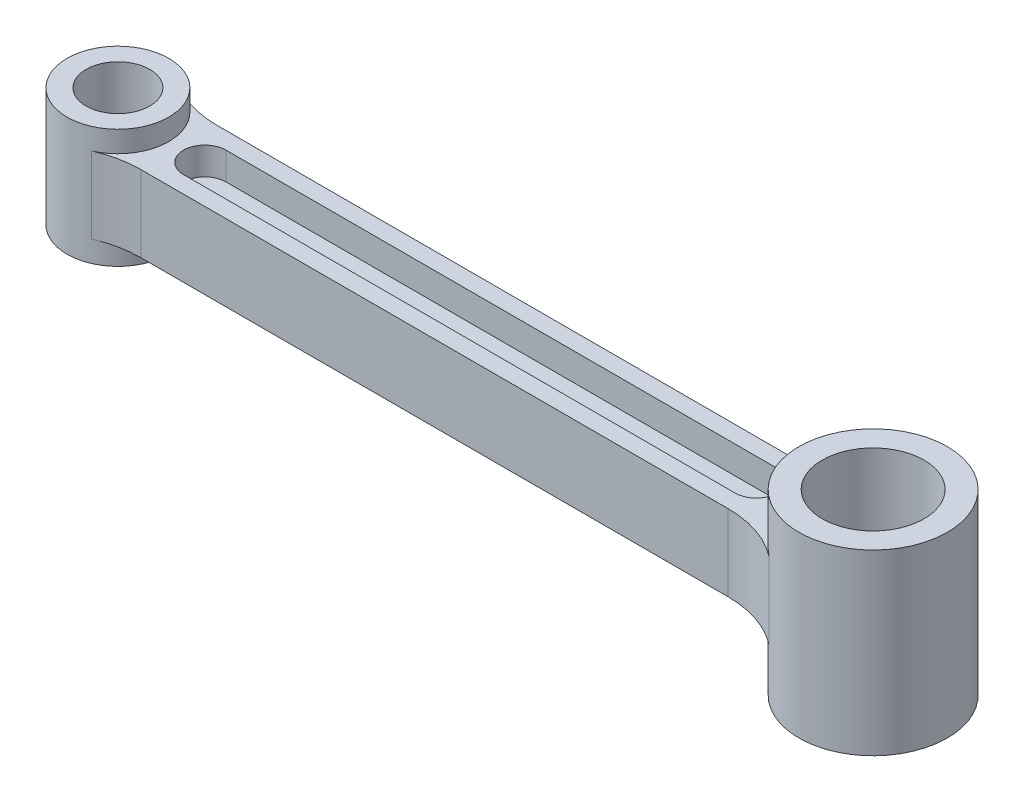
ISO-10303-21;
HEADER;
FILE_DESCRIPTION(('STEP AP214'),'2;1');
FILE_NAME('part.step','',(''),(''),'','','');
FILE_SCHEMA(('AUTOMOTIVE_DESIGN { 1 0 10303 214 1 1 1 1 }'));
ENDSEC;
DATA;
#1=APPLICATION_CONTEXT('core data for automotive mechanical design processes');
#2=APPLICATION_PROTOCOL_DEFINITION('international standard','automotive_design',2000,#1);
#3=PRODUCT_CONTEXT('',#1,'mechanical');
#4=PRODUCT('Part','Part','',(#3));
#5=PRODUCT_RELATED_PRODUCT_CATEGORY('part','',(#4));
#6=PRODUCT_DEFINITION_FORMATION('','',#4);
#7=PRODUCT_DEFINITION_CONTEXT('part definition',#1,'design');
#8=PRODUCT_DEFINITION('design','',#6,#7);
#9=PRODUCT_DEFINITION_SHAPE('','',#8);
#10=(LENGTH_UNIT() NAMED_UNIT(*) SI_UNIT(.MILLI.,.METRE.));
#11=(NAMED_UNIT(*) PLANE_ANGLE_UNIT() SI_UNIT($,.RADIAN.));
#12=(NAMED_UNIT(*) SI_UNIT($,.STERADIAN.) SOLID_ANGLE_UNIT());
#13=UNCERTAINTY_MEASURE_WITH_UNIT(LENGTH_MEASURE(1.E-05),#10,'distance_accuracy_value','');
#14=(GEOMETRIC_REPRESENTATION_CONTEXT(3) GLOBAL_UNCERTAINTY_ASSIGNED_CONTEXT((#13)) GLOBAL_UNIT_ASSIGNED_CONTEXT((#10,
#11,#12)) REPRESENTATION_CONTEXT('',''));
#15=CARTESIAN_POINT('',(0.,0.,0.));
#16=DIRECTION('',(0.,0.,1.));
#17=DIRECTION('',(1.,0.,0.));
#18=AXIS2_PLACEMENT_3D('',#15,#16,#17);
#19=CARTESIAN_POINT('',(178.,0.,9.));
#20=DIRECTION('',(0.,1.,0.));
#21=DIRECTION('',(-1.,0.,0.));
#22=AXIS2_PLACEMENT_3D('',#19,#20,#21);
#23=PLANE('',#22);
#24=CARTESIAN_POINT('',(0.,0.,0.));
#25=DIRECTION('',(0.,1.,0.));
#26=DIRECTION('',(-1.,0.,0.));
#27=AXIS2_PLACEMENT_3D('',#24,#25,#26);
#28=CIRCLE('',#27,12.);
#29=CARTESIAN_POINT('',(4.79583152331272,0.,11.));
#30=VERTEX_POINT('',#29);
#31=CARTESIAN_POINT('',(4.79583152331272,0.,-11.));
#32=VERTEX_POINT('',#31);
#33=EDGE_CURVE('E76',#30,#32,#28,.T.);
#34=ORIENTED_EDGE('',*,*,#33,.T.);
#35=CARTESIAN_POINT('',(14.3874945699382,0.,-33.));
#36=DIRECTION('',(0.,1.,0.));
#37=DIRECTION('',(-1.,0.,0.));
#38=AXIS2_PLACEMENT_3D('',#35,#36,#37);
#39=CIRCLE('',#38,24.);
#40=CARTESIAN_POINT('',(14.3874945699382,0.,-9.));
#41=VERTEX_POINT('',#40);
#42=EDGE_CURVE('E311',#32,#41,#39,.T.);
#43=ORIENTED_EDGE('',*,*,#42,.T.);
#44=DIRECTION('',(1.,0.,0.));
#45=VECTOR('',#44,1.);
#46=CARTESIAN_POINT('',(178.,0.,-9.));
#47=LINE('',#46,#45);
#48=CARTESIAN_POINT('',(152.844799755799,0.,-9.));
#49=VERTEX_POINT('',#48);
#50=EDGE_CURVE('E269',#41,#49,#47,.T.);
#51=ORIENTED_EDGE('',*,*,#50,.T.);
#52=CARTESIAN_POINT('',(152.844799755799,0.,-33.));
#53=DIRECTION('',(0.,1.,0.));
#54=DIRECTION('',(-1.,0.,0.));
#55=AXIS2_PLACEMENT_3D('',#52,#53,#54);
#56=CIRCLE('',#55,24.);
#57=CARTESIAN_POINT('',(167.397739937577,0.,-13.9156626506024));
#58=VERTEX_POINT('',#57);
#59=EDGE_CURVE('E308',#49,#58,#56,.T.);
#60=ORIENTED_EDGE('',*,*,#59,.T.);
#61=CARTESIAN_POINT('',(178.009258820123,0.,0.));
#62=DIRECTION('',(0.,1.,0.));
#63=DIRECTION('',(-1.,0.,0.));
#64=AXIS2_PLACEMENT_3D('',#61,#62,#63);
#65=CIRCLE('',#64,17.5);
#66=CARTESIAN_POINT('',(167.397739937577,0.,13.9156626506024));
#67=VERTEX_POINT('',#66);
#68=EDGE_CURVE('E259',#58,#67,#65,.T.);
#69=ORIENTED_EDGE('',*,*,#68,.T.);
#70=CARTESIAN_POINT('',(152.844799755799,0.,33.));
#71=DIRECTION('',(0.,1.,0.));
#72=DIRECTION('',(-1.,0.,0.));
#73=AXIS2_PLACEMENT_3D('',#70,#71,#72);
#74=CIRCLE('',#73,24.);
#75=CARTESIAN_POINT('',(152.844799755799,0.,9.));
#76=VERTEX_POINT('',#75);
#77=EDGE_CURVE('E304',#67,#76,#74,.T.);
#78=ORIENTED_EDGE('',*,*,#77,.T.);
#79=DIRECTION('',(1.,0.,0.));
#80=VECTOR('',#79,1.);
#81=CARTESIAN_POINT('',(178.,0.,9.));
#82=LINE('',#81,#80);
#83=CARTESIAN_POINT('',(14.3874945699382,0.,9.));
#84=VERTEX_POINT('',#83);
#85=EDGE_CURVE('E270',#84,#76,#82,.T.);
#86=ORIENTED_EDGE('',*,*,#85,.F.);
#87=CARTESIAN_POINT('',(14.3874945699382,0.,33.));
#88=DIRECTION('',(0.,1.,0.));
#89=DIRECTION('',(-1.,0.,0.));
#90=AXIS2_PLACEMENT_3D('',#87,#88,#89);
#91=CIRCLE('',#90,24.);
#92=EDGE_CURVE('E69',#84,#30,#91,.T.);
#93=ORIENTED_EDGE('',*,*,#92,.T.);
#94=EDGE_LOOP('',(#34,#43,#51,#60,#69,#78,#86,#93));
#95=FACE_BOUND('',#94,.T.);
#96=CARTESIAN_POINT('',(20.4690908667564,0.,0.));
#97=DIRECTION('',(0.,1.,0.));
#98=DIRECTION('',(0.,0.,1.));
#99=AXIS2_PLACEMENT_3D('',#96,#97,#98);
#100=CIRCLE('',#99,5.);
#101=CARTESIAN_POINT('',(20.4690908667564,0.,-5.));
#102=VERTEX_POINT('',#101);
#103=CARTESIAN_POINT('',(20.4690908667564,0.,5.));
#104=VERTEX_POINT('',#103);
#105=EDGE_CURVE('E194',#102,#104,#100,.T.);
#106=ORIENTED_EDGE('',*,*,#105,.T.);
#107=DIRECTION('',(1.,0.,0.));
#108=VECTOR('',#107,1.);
#109=CARTESIAN_POINT('',(20.4690908667564,0.,5.));
#110=LINE('',#109,#108);
#111=CARTESIAN_POINT('',(150.469090866756,0.,4.99999999999998));
#112=VERTEX_POINT('',#111);
#113=EDGE_CURVE('E198',#104,#112,#110,.T.);
#114=ORIENTED_EDGE('',*,*,#113,.T.);
#115=CARTESIAN_POINT('',(150.469090866756,0.,0.));
#116=DIRECTION('',(0.,1.,0.));
#117=DIRECTION('',(0.,0.,1.));
#118=AXIS2_PLACEMENT_3D('',#115,#116,#117);
#119=CIRCLE('',#118,4.99999999999998);
#120=CARTESIAN_POINT('',(150.469090866756,0.,-5.00000000000002));
#121=VERTEX_POINT('',#120);
#122=EDGE_CURVE('E201',#112,#121,#119,.T.);
#123=ORIENTED_EDGE('',*,*,#122,.T.);
#124=DIRECTION('',(-1.,0.,0.));
#125=VECTOR('',#124,1.);
#126=CARTESIAN_POINT('',(20.4690908667564,0.,-5.));
#127=LINE('',#126,#125);
#128=EDGE_CURVE('E210',#121,#102,#127,.T.);
#129=ORIENTED_EDGE('',*,*,#128,.T.);
#130=EDGE_LOOP('',(#106,#114,#123,#129));
#131=FACE_BOUND('',#130,.T.);
#132=ADVANCED_FACE('F61',(#95,#131),#23,.F.);
#133=CARTESIAN_POINT('',(0.,18.,9.));
#134=DIRECTION('',(0.,-1.,0.));
#135=DIRECTION('',(0.,0.,-1.));
#136=AXIS2_PLACEMENT_3D('',#133,#134,#135);
#137=PLANE('',#136);
#138=DIRECTION('',(1.,0.,0.));
#139=VECTOR('',#138,1.);
#140=CARTESIAN_POINT('',(20.4690908667564,18.,5.));
#141=LINE('',#140,#139);
#142=CARTESIAN_POINT('',(20.4690908667564,18.,5.));
#143=VERTEX_POINT('',#142);
#144=CARTESIAN_POINT('',(150.469090866756,18.,4.99999999999998));
#145=VERTEX_POINT('',#144);
#146=EDGE_CURVE('E235',#143,#145,#141,.T.);
#147=ORIENTED_EDGE('',*,*,#146,.F.);
#148=CARTESIAN_POINT('',(20.4690908667564,18.,0.));
#149=DIRECTION('',(0.,1.,0.));
#150=DIRECTION('',(0.,0.,1.));
#151=AXIS2_PLACEMENT_3D('',#148,#149,#150);
#152=CIRCLE('',#151,5.);
#153=CARTESIAN_POINT('',(20.4690908667564,18.,-5.));
#154=VERTEX_POINT('',#153);
#155=EDGE_CURVE('E216',#154,#143,#152,.T.);
#156=ORIENTED_EDGE('',*,*,#155,.F.);
#157=DIRECTION('',(-1.,0.,0.));
#158=VECTOR('',#157,1.);
#159=CARTESIAN_POINT('',(20.4690908667564,18.,-5.));
#160=LINE('',#159,#158);
#161=CARTESIAN_POINT('',(150.469090866756,18.,-5.00000000000002));
#162=VERTEX_POINT('',#161);
#163=EDGE_CURVE('E224',#162,#154,#160,.T.);
#164=ORIENTED_EDGE('',*,*,#163,.F.);
#165=CARTESIAN_POINT('',(150.469090866756,18.,0.));
#166=DIRECTION('',(0.,1.,0.));
#167=DIRECTION('',(0.,0.,1.));
#168=AXIS2_PLACEMENT_3D('',#165,#166,#167);
#169=CIRCLE('',#168,4.99999999999998);
#170=EDGE_CURVE('E238',#145,#162,#169,.T.);
#171=ORIENTED_EDGE('',*,*,#170,.F.);
#172=EDGE_LOOP('',(#147,#156,#164,#171));
#173=FACE_BOUND('',#172,.T.);
#174=DIRECTION('',(-1.,0.,0.));
#175=VECTOR('',#174,1.);
#176=CARTESIAN_POINT('',(0.,18.,9.));
#177=LINE('',#176,#175);
#178=CARTESIAN_POINT('',(152.844799755799,18.,9.));
#179=VERTEX_POINT('',#178);
#180=CARTESIAN_POINT('',(14.3874945699382,18.,9.));
#181=VERTEX_POINT('',#180);
#182=EDGE_CURVE('E273',#179,#181,#177,.T.);
#183=ORIENTED_EDGE('',*,*,#182,.F.);
#184=CARTESIAN_POINT('',(152.844799755799,18.,33.));
#185=DIRECTION('',(0.,-1.,0.));
#186=DIRECTION('',(0.,0.,-1.));
#187=AXIS2_PLACEMENT_3D('',#184,#185,#186);
#188=CIRCLE('',#187,24.);
#189=CARTESIAN_POINT('',(167.397739937577,18.,13.9156626506024));
#190=VERTEX_POINT('',#189);
#191=EDGE_CURVE('E301',#179,#190,#188,.T.);
#192=ORIENTED_EDGE('',*,*,#191,.T.);
#193=CARTESIAN_POINT('',(178.009258820123,18.,0.));
#194=DIRECTION('',(0.,-1.,0.));
#195=DIRECTION('',(0.,0.,-1.));
#196=AXIS2_PLACEMENT_3D('',#193,#194,#195);
#197=CIRCLE('',#196,17.5);
#198=CARTESIAN_POINT('',(167.397739937577,18.,-13.9156626506024));
#199=VERTEX_POINT('',#198);
#200=EDGE_CURVE('E257',#190,#199,#197,.T.);
#201=ORIENTED_EDGE('',*,*,#200,.T.);
#202=CARTESIAN_POINT('',(152.844799755799,18.,-33.));
#203=DIRECTION('',(0.,-1.,0.));
#204=DIRECTION('',(0.,0.,-1.));
#205=AXIS2_PLACEMENT_3D('',#202,#203,#204);
#206=CIRCLE('',#205,24.);
#207=CARTESIAN_POINT('',(152.844799755799,18.,-9.));
#208=VERTEX_POINT('',#207);
#209=EDGE_CURVE('E306',#199,#208,#206,.T.);
#210=ORIENTED_EDGE('',*,*,#209,.T.);
#211=DIRECTION('',(-1.,0.,0.));
#212=VECTOR('',#211,1.);
#213=CARTESIAN_POINT('',(0.,18.,-9.));
#214=LINE('',#213,#212);
#215=CARTESIAN_POINT('',(14.3874945699382,18.,-9.));
#216=VERTEX_POINT('',#215);
#217=EDGE_CURVE('E274',#208,#216,#214,.T.);
#218=ORIENTED_EDGE('',*,*,#217,.T.);
#219=CARTESIAN_POINT('',(14.3874945699382,18.,-33.));
#220=DIRECTION('',(0.,-1.,0.));
#221=DIRECTION('',(0.,0.,-1.));
#222=AXIS2_PLACEMENT_3D('',#219,#220,#221);
#223=CIRCLE('',#222,24.);
#224=CARTESIAN_POINT('',(4.79583152331272,18.,-11.));
#225=VERTEX_POINT('',#224);
#226=EDGE_CURVE('E313',#216,#225,#223,.T.);
#227=ORIENTED_EDGE('',*,*,#226,.T.);
#228=CARTESIAN_POINT('',(0.,18.,0.));
#229=DIRECTION('',(0.,-1.,0.));
#230=DIRECTION('',(0.,0.,-1.));
#231=AXIS2_PLACEMENT_3D('',#228,#229,#230);
#232=CIRCLE('',#231,12.);
#233=CARTESIAN_POINT('',(4.79583152331272,18.,11.));
#234=VERTEX_POINT('',#233);
#235=EDGE_CURVE('E84',#225,#234,#232,.T.);
#236=ORIENTED_EDGE('',*,*,#235,.T.);
#237=CARTESIAN_POINT('',(14.3874945699382,18.,33.));
#238=DIRECTION('',(0.,-1.,0.));
#239=DIRECTION('',(0.,0.,-1.));
#240=AXIS2_PLACEMENT_3D('',#237,#238,#239);
#241=CIRCLE('',#240,24.);
#242=EDGE_CURVE('E12',#234,#181,#241,.T.);
#243=ORIENTED_EDGE('',*,*,#242,.T.);
#244=EDGE_LOOP('',(#183,#192,#201,#210,#218,#227,#236,#243));
#245=FACE_BOUND('',#244,.T.);
#246=ADVANCED_FACE('F347',(#173,#245),#137,.F.);
#247=CARTESIAN_POINT('',(0.,0.,9.));
#248=DIRECTION('',(0.,0.,-1.));
#249=DIRECTION('',(-1.,0.,0.));
#250=AXIS2_PLACEMENT_3D('',#247,#248,#249);
#251=PLANE('',#250);
#252=ORIENTED_EDGE('',*,*,#85,.T.);
#253=DIRECTION('',(0.,-1.,0.));
#254=VECTOR('',#253,1.);
#255=CARTESIAN_POINT('',(152.844799755799,0.,9.));
#256=LINE('',#255,#254);
#257=EDGE_CURVE('E284',#76,#179,#256,.F.);
#258=ORIENTED_EDGE('',*,*,#257,.T.);
#259=ORIENTED_EDGE('',*,*,#182,.T.);
#260=DIRECTION('',(0.,1.,0.));
#261=VECTOR('',#260,1.);
#262=CARTESIAN_POINT('',(14.3874945699382,0.,9.));
#263=LINE('',#262,#261);
#264=EDGE_CURVE('E277',#181,#84,#263,.F.);
#265=ORIENTED_EDGE('',*,*,#264,.T.);
#266=EDGE_LOOP('',(#252,#258,#259,#265));
#267=FACE_BOUND('',#266,.T.);
#268=ADVANCED_FACE('F345',(#267),#251,.F.);
#269=CARTESIAN_POINT('',(0.,0.,-9.));
#270=DIRECTION('',(0.,0.,-1.));
#271=DIRECTION('',(-1.,0.,0.));
#272=AXIS2_PLACEMENT_3D('',#269,#270,#271);
#273=PLANE('',#272);
#274=ORIENTED_EDGE('',*,*,#217,.F.);
#275=DIRECTION('',(0.,1.,0.));
#276=VECTOR('',#275,1.);
#277=CARTESIAN_POINT('',(152.844799755799,0.,-9.));
#278=LINE('',#277,#276);
#279=EDGE_CURVE('E295',#208,#49,#278,.F.);
#280=ORIENTED_EDGE('',*,*,#279,.T.);
#281=ORIENTED_EDGE('',*,*,#50,.F.);
#282=DIRECTION('',(0.,-1.,0.));
#283=VECTOR('',#282,1.);
#284=CARTESIAN_POINT('',(14.3874945699382,18.,-9.));
#285=LINE('',#284,#283);
#286=EDGE_CURVE('E293',#41,#216,#285,.F.);
#287=ORIENTED_EDGE('',*,*,#286,.T.);
#288=EDGE_LOOP('',(#274,#280,#281,#287));
#289=FACE_BOUND('',#288,.T.);
#290=ADVANCED_FACE('F330',(#289),#273,.T.);
#291=CARTESIAN_POINT('',(0.,-5.00000000000001,0.));
#292=DIRECTION('',(0.,1.,0.));
#293=DIRECTION('',(-1.,0.,0.));
#294=AXIS2_PLACEMENT_3D('',#291,#292,#293);
#295=CYLINDRICAL_SURFACE('',#294,12.);
#296=CARTESIAN_POINT('',(0.,-5.00000000000001,0.));
#297=DIRECTION('',(0.,1.,0.));
#298=DIRECTION('',(-1.,0.,0.));
#299=AXIS2_PLACEMENT_3D('',#296,#297,#298);
#300=CIRCLE('',#299,12.);
#301=CARTESIAN_POINT('',(-12.,-5.00000000000001,0.));
#302=VERTEX_POINT('',#301);
#303=EDGE_CURVE('E261',#302,#302,#300,.T.);
#304=ORIENTED_EDGE('',*,*,#303,.T.);
#305=EDGE_LOOP('',(#304));
#306=FACE_BOUND('',#305,.T.);
#307=CARTESIAN_POINT('',(0.,23.,0.));
#308=DIRECTION('',(0.,1.,0.));
#309=DIRECTION('',(-1.,0.,0.));
#310=AXIS2_PLACEMENT_3D('',#307,#308,#309);
#311=CIRCLE('',#310,12.);
#312=CARTESIAN_POINT('',(-12.,23.,0.));
#313=VERTEX_POINT('',#312);
#314=EDGE_CURVE('E264',#313,#313,#311,.T.);
#315=ORIENTED_EDGE('',*,*,#314,.F.);
#316=EDGE_LOOP('',(#315));
#317=FACE_BOUND('',#316,.T.);
#318=DIRECTION('',(0.,1.,0.));
#319=VECTOR('',#318,1.);
#320=CARTESIAN_POINT('',(4.79583152331272,-5.00000000000001,-11.));
#321=LINE('',#320,#319);
#322=EDGE_CURVE('E299',#225,#32,#321,.F.);
#323=ORIENTED_EDGE('',*,*,#322,.T.);
#324=ORIENTED_EDGE('',*,*,#33,.F.);
#325=DIRECTION('',(0.,1.,0.));
#326=VECTOR('',#325,1.);
#327=CARTESIAN_POINT('',(4.79583152331272,-5.00000000000001,11.));
#328=LINE('',#327,#326);
#329=EDGE_CURVE('E297',#30,#234,#328,.T.);
#330=ORIENTED_EDGE('',*,*,#329,.T.);
#331=ORIENTED_EDGE('',*,*,#235,.F.);
#332=EDGE_LOOP('',(#323,#324,#330,#331));
#333=FACE_BOUND('',#332,.T.);
#334=ADVANCED_FACE('F320',(#306,#317,#333),#295,.T.);
#335=CARTESIAN_POINT('',(0.,-5.00000000000001,0.));
#336=DIRECTION('',(0.,1.,0.));
#337=DIRECTION('',(-1.,0.,0.));
#338=AXIS2_PLACEMENT_3D('',#335,#336,#337);
#339=PLANE('',#338);
#340=CARTESIAN_POINT('',(0.,-5.00000000000001,0.));
#341=DIRECTION('',(0.,1.,0.));
#342=DIRECTION('',(-1.,0.,0.));
#343=AXIS2_PLACEMENT_3D('',#340,#341,#342);
#344=CIRCLE('',#343,7.5);
#345=CARTESIAN_POINT('',(-7.5,-5.00000000000001,0.));
#346=VERTEX_POINT('',#345);
#347=EDGE_CURVE('E648',#346,#346,#344,.F.);
#348=ORIENTED_EDGE('',*,*,#347,.F.);
#349=EDGE_LOOP('',(#348));
#350=FACE_BOUND('',#349,.T.);
#351=ORIENTED_EDGE('',*,*,#303,.F.);
#352=EDGE_LOOP('',(#351));
#353=FACE_BOUND('',#352,.T.);
#354=ADVANCED_FACE('F406',(#350,#353),#339,.F.);
#355=CARTESIAN_POINT('',(0.,23.,0.));
#356=DIRECTION('',(0.,1.,0.));
#357=DIRECTION('',(-1.,0.,0.));
#358=AXIS2_PLACEMENT_3D('',#355,#356,#357);
#359=PLANE('',#358);
#360=CARTESIAN_POINT('',(0.,23.,0.));
#361=DIRECTION('',(0.,1.,0.));
#362=DIRECTION('',(-1.,0.,0.));
#363=AXIS2_PLACEMENT_3D('',#360,#361,#362);
#364=CIRCLE('',#363,7.5);
#365=CARTESIAN_POINT('',(-7.5,23.,0.));
#366=VERTEX_POINT('',#365);
#367=EDGE_CURVE('E204',#366,#366,#364,.F.);
#368=ORIENTED_EDGE('',*,*,#367,.T.);
#369=EDGE_LOOP('',(#368));
#370=FACE_BOUND('',#369,.T.);
#371=ORIENTED_EDGE('',*,*,#314,.T.);
#372=EDGE_LOOP('',(#371));
#373=FACE_BOUND('',#372,.T.);
#374=ADVANCED_FACE('F402',(#370,#373),#359,.T.);
#375=CARTESIAN_POINT('',(178.009258820123,30.,0.));
#376=DIRECTION('',(0.,-1.,0.));
#377=DIRECTION('',(0.,0.,-1.));
#378=AXIS2_PLACEMENT_3D('',#375,#376,#377);
#379=CYLINDRICAL_SURFACE('',#378,17.5);
#380=CARTESIAN_POINT('',(178.009258820123,30.,0.));
#381=DIRECTION('',(0.,-1.,0.));
#382=DIRECTION('',(0.,0.,-1.));
#383=AXIS2_PLACEMENT_3D('',#380,#381,#382);
#384=CIRCLE('',#383,17.5);
#385=CARTESIAN_POINT('',(178.009258820123,30.,-17.5));
#386=VERTEX_POINT('',#385);
#387=EDGE_CURVE('E245',#386,#386,#384,.T.);
#388=ORIENTED_EDGE('',*,*,#387,.T.);
#389=EDGE_LOOP('',(#388));
#390=FACE_BOUND('',#389,.T.);
#391=CARTESIAN_POINT('',(178.009258820123,-12.,0.));
#392=DIRECTION('',(0.,-1.,0.));
#393=DIRECTION('',(0.,0.,-1.));
#394=AXIS2_PLACEMENT_3D('',#391,#392,#393);
#395=CIRCLE('',#394,17.5);
#396=CARTESIAN_POINT('',(178.009258820123,-12.,-17.5));
#397=VERTEX_POINT('',#396);
#398=EDGE_CURVE('E254',#397,#397,#395,.T.);
#399=ORIENTED_EDGE('',*,*,#398,.F.);
#400=EDGE_LOOP('',(#399));
#401=FACE_BOUND('',#400,.T.);
#402=ORIENTED_EDGE('',*,*,#200,.F.);
#403=DIRECTION('',(0.,-1.,0.));
#404=VECTOR('',#403,1.);
#405=CARTESIAN_POINT('',(167.397739937577,30.,13.9156626506024));
#406=LINE('',#405,#404);
#407=EDGE_CURVE('E290',#190,#67,#406,.T.);
#408=ORIENTED_EDGE('',*,*,#407,.T.);
#409=ORIENTED_EDGE('',*,*,#68,.F.);
#410=DIRECTION('',(0.,-1.,0.));
#411=VECTOR('',#410,1.);
#412=CARTESIAN_POINT('',(167.397739937577,30.,-13.9156626506024));
#413=LINE('',#412,#411);
#414=EDGE_CURVE('E287',#58,#199,#413,.F.);
#415=ORIENTED_EDGE('',*,*,#414,.T.);
#416=EDGE_LOOP('',(#402,#408,#409,#415));
#417=FACE_BOUND('',#416,.T.);
#418=ADVANCED_FACE('F339',(#390,#401,#417),#379,.T.);
#419=CARTESIAN_POINT('',(178.009258820123,30.,0.));
#420=DIRECTION('',(0.,-1.,0.));
#421=DIRECTION('',(0.,0.,-1.));
#422=AXIS2_PLACEMENT_3D('',#419,#420,#421);
#423=PLANE('',#422);
#424=CARTESIAN_POINT('',(178.009258820123,30.,0.));
#425=DIRECTION('',(0.,-1.,0.));
#426=DIRECTION('',(0.,0.,-1.));
#427=AXIS2_PLACEMENT_3D('',#424,#425,#426);
#428=CIRCLE('',#427,12.);
#429=CARTESIAN_POINT('',(178.009258820123,30.,-12.));
#430=VERTEX_POINT('',#429);
#431=EDGE_CURVE('E656',#430,#430,#428,.F.);
#432=ORIENTED_EDGE('',*,*,#431,.F.);
#433=EDGE_LOOP('',(#432));
#434=FACE_BOUND('',#433,.T.);
#435=ORIENTED_EDGE('',*,*,#387,.F.);
#436=EDGE_LOOP('',(#435));
#437=FACE_BOUND('',#436,.T.);
#438=ADVANCED_FACE('F401',(#434,#437),#423,.F.);
#439=CARTESIAN_POINT('',(178.009258820123,-12.,0.));
#440=DIRECTION('',(0.,-1.,0.));
#441=DIRECTION('',(0.,0.,-1.));
#442=AXIS2_PLACEMENT_3D('',#439,#440,#441);
#443=PLANE('',#442);
#444=CARTESIAN_POINT('',(178.009258820123,-12.,0.));
#445=DIRECTION('',(0.,-1.,0.));
#446=DIRECTION('',(0.,0.,-1.));
#447=AXIS2_PLACEMENT_3D('',#444,#445,#446);
#448=CIRCLE('',#447,12.);
#449=CARTESIAN_POINT('',(178.009258820123,-12.,-12.));
#450=VERTEX_POINT('',#449);
#451=EDGE_CURVE('E653',#450,#450,#448,.F.);
#452=ORIENTED_EDGE('',*,*,#451,.T.);
#453=EDGE_LOOP('',(#452));
#454=FACE_BOUND('',#453,.T.);
#455=ORIENTED_EDGE('',*,*,#398,.T.);
#456=EDGE_LOOP('',(#455));
#457=FACE_BOUND('',#456,.T.);
#458=ADVANCED_FACE('F405',(#454,#457),#443,.T.);
#459=CARTESIAN_POINT('',(20.4690908667564,11.5,0.));
#460=DIRECTION('',(0.,1.,0.));
#461=DIRECTION('',(0.,0.,1.));
#462=AXIS2_PLACEMENT_3D('',#459,#460,#461);
#463=CYLINDRICAL_SURFACE('',#462,5.);
#464=ORIENTED_EDGE('',*,*,#155,.T.);
#465=DIRECTION('',(0.,1.,0.));
#466=VECTOR('',#465,1.);
#467=CARTESIAN_POINT('',(20.4690908667564,11.5,5.));
#468=LINE('',#467,#466);
#469=CARTESIAN_POINT('',(20.4690908667564,11.5,5.));
#470=VERTEX_POINT('',#469);
#471=EDGE_CURVE('E233',#470,#143,#468,.T.);
#472=ORIENTED_EDGE('',*,*,#471,.F.);
#473=CARTESIAN_POINT('',(20.4690908667564,11.5,0.));
#474=DIRECTION('',(0.,1.,0.));
#475=DIRECTION('',(0.,0.,1.));
#476=AXIS2_PLACEMENT_3D('',#473,#474,#475);
#477=CIRCLE('',#476,5.);
#478=CARTESIAN_POINT('',(20.4690908667564,11.5,-5.));
#479=VERTEX_POINT('',#478);
#480=EDGE_CURVE('E220',#479,#470,#477,.T.);
#481=ORIENTED_EDGE('',*,*,#480,.F.);
#482=DIRECTION('',(0.,1.,0.));
#483=VECTOR('',#482,1.);
#484=CARTESIAN_POINT('',(20.4690908667564,11.5,-5.));
#485=LINE('',#484,#483);
#486=EDGE_CURVE('E243',#479,#154,#485,.T.);
#487=ORIENTED_EDGE('',*,*,#486,.T.);
#488=EDGE_LOOP('',(#464,#472,#481,#487));
#489=FACE_BOUND('',#488,.T.);
#490=ADVANCED_FACE('F470',(#489),#463,.F.);
#491=CARTESIAN_POINT('',(20.4690908667564,11.5,-5.));
#492=DIRECTION('',(0.,0.,-1.));
#493=DIRECTION('',(-1.,0.,0.));
#494=AXIS2_PLACEMENT_3D('',#491,#492,#493);
#495=PLANE('',#494);
#496=ORIENTED_EDGE('',*,*,#163,.T.);
#497=ORIENTED_EDGE('',*,*,#486,.F.);
#498=DIRECTION('',(-1.,0.,0.));
#499=VECTOR('',#498,1.);
#500=CARTESIAN_POINT('',(20.4690908667564,11.5,-5.));
#501=LINE('',#500,#499);
#502=CARTESIAN_POINT('',(150.469090866756,11.5,-5.00000000000002));
#503=VERTEX_POINT('',#502);
#504=EDGE_CURVE('E230',#503,#479,#501,.T.);
#505=ORIENTED_EDGE('',*,*,#504,.F.);
#506=DIRECTION('',(0.,1.,0.));
#507=VECTOR('',#506,1.);
#508=CARTESIAN_POINT('',(150.469090866756,11.5,-5.00000000000002));
#509=LINE('',#508,#507);
#510=EDGE_CURVE('E246',#503,#162,#509,.T.);
#511=ORIENTED_EDGE('',*,*,#510,.T.);
#512=EDGE_LOOP('',(#496,#497,#505,#511));
#513=FACE_BOUND('',#512,.T.);
#514=ADVANCED_FACE('F585',(#513),#495,.F.);
#515=CARTESIAN_POINT('',(150.469090866756,11.5,0.));
#516=DIRECTION('',(0.,1.,0.));
#517=DIRECTION('',(0.,0.,1.));
#518=AXIS2_PLACEMENT_3D('',#515,#516,#517);
#519=CYLINDRICAL_SURFACE('',#518,4.99999999999998);
#520=ORIENTED_EDGE('',*,*,#170,.T.);
#521=ORIENTED_EDGE('',*,*,#510,.F.);
#522=CARTESIAN_POINT('',(150.469090866756,11.5,0.));
#523=DIRECTION('',(0.,1.,0.));
#524=DIRECTION('',(0.,0.,1.));
#525=AXIS2_PLACEMENT_3D('',#522,#523,#524);
#526=CIRCLE('',#525,4.99999999999998);
#527=CARTESIAN_POINT('',(150.469090866756,11.5,4.99999999999998));
#528=VERTEX_POINT('',#527);
#529=EDGE_CURVE('E227',#528,#503,#526,.T.);
#530=ORIENTED_EDGE('',*,*,#529,.F.);
#531=DIRECTION('',(0.,1.,0.));
#532=VECTOR('',#531,1.);
#533=CARTESIAN_POINT('',(150.469090866756,11.5,4.99999999999998));
#534=LINE('',#533,#532);
#535=EDGE_CURVE('E248',#528,#145,#534,.T.);
#536=ORIENTED_EDGE('',*,*,#535,.T.);
#537=EDGE_LOOP('',(#520,#521,#530,#536));
#538=FACE_BOUND('',#537,.T.);
#539=ADVANCED_FACE('F574',(#538),#519,.F.);
#540=CARTESIAN_POINT('',(20.4690908667564,11.5,5.));
#541=DIRECTION('',(0.,0.,1.));
#542=DIRECTION('',(1.,0.,0.));
#543=AXIS2_PLACEMENT_3D('',#540,#541,#542);
#544=PLANE('',#543);
#545=ORIENTED_EDGE('',*,*,#146,.T.);
#546=ORIENTED_EDGE('',*,*,#535,.F.);
#547=DIRECTION('',(1.,0.,0.));
#548=VECTOR('',#547,1.);
#549=CARTESIAN_POINT('',(20.4690908667564,11.5,5.));
#550=LINE('',#549,#548);
#551=EDGE_CURVE('E223',#470,#528,#550,.T.);
#552=ORIENTED_EDGE('',*,*,#551,.F.);
#553=ORIENTED_EDGE('',*,*,#471,.T.);
#554=EDGE_LOOP('',(#545,#546,#552,#553));
#555=FACE_BOUND('',#554,.T.);
#556=ADVANCED_FACE('F564',(#555),#544,.F.);
#557=CARTESIAN_POINT('',(20.4690908667564,11.5,0.));
#558=DIRECTION('',(0.,1.,0.));
#559=DIRECTION('',(0.,0.,1.));
#560=AXIS2_PLACEMENT_3D('',#557,#558,#559);
#561=PLANE('',#560);
#562=ORIENTED_EDGE('',*,*,#480,.T.);
#563=ORIENTED_EDGE('',*,*,#551,.T.);
#564=ORIENTED_EDGE('',*,*,#529,.T.);
#565=ORIENTED_EDGE('',*,*,#504,.T.);
#566=EDGE_LOOP('',(#562,#563,#564,#565));
#567=FACE_BOUND('',#566,.T.);
#568=ADVANCED_FACE('F555',(#567),#561,.T.);
#569=CARTESIAN_POINT('',(20.4690908667564,6.5,0.));
#570=DIRECTION('',(0.,-1.,0.));
#571=DIRECTION('',(1.,0.,0.));
#572=AXIS2_PLACEMENT_3D('',#569,#570,#571);
#573=CYLINDRICAL_SURFACE('',#572,5.);
#574=ORIENTED_EDGE('',*,*,#105,.F.);
#575=DIRECTION('',(0.,-1.,0.));
#576=VECTOR('',#575,1.);
#577=CARTESIAN_POINT('',(20.4690908667564,6.5,-5.));
#578=LINE('',#577,#576);
#579=CARTESIAN_POINT('',(20.4690908667564,6.5,-5.));
#580=VERTEX_POINT('',#579);
#581=EDGE_CURVE('E179',#580,#102,#578,.T.);
#582=ORIENTED_EDGE('',*,*,#581,.F.);
#583=CARTESIAN_POINT('',(20.4690908667564,6.5,0.));
#584=DIRECTION('',(0.,1.,0.));
#585=DIRECTION('',(0.,0.,1.));
#586=AXIS2_PLACEMENT_3D('',#583,#584,#585);
#587=CIRCLE('',#586,5.);
#588=CARTESIAN_POINT('',(20.4690908667564,6.5,5.));
#589=VERTEX_POINT('',#588);
#590=EDGE_CURVE('E186',#580,#589,#587,.T.);
#591=ORIENTED_EDGE('',*,*,#590,.T.);
#592=DIRECTION('',(0.,-1.,0.));
#593=VECTOR('',#592,1.);
#594=CARTESIAN_POINT('',(20.4690908667564,6.5,5.));
#595=LINE('',#594,#593);
#596=EDGE_CURVE('E214',#589,#104,#595,.T.);
#597=ORIENTED_EDGE('',*,*,#596,.T.);
#598=EDGE_LOOP('',(#574,#582,#591,#597));
#599=FACE_BOUND('',#598,.T.);
#600=ADVANCED_FACE('F190',(#599),#573,.F.);
#601=CARTESIAN_POINT('',(20.4690908667564,6.5,5.));
#602=DIRECTION('',(0.,0.,-1.));
#603=DIRECTION('',(-1.,0.,0.));
#604=AXIS2_PLACEMENT_3D('',#601,#602,#603);
#605=PLANE('',#604);
#606=ORIENTED_EDGE('',*,*,#113,.F.);
#607=ORIENTED_EDGE('',*,*,#596,.F.);
#608=DIRECTION('',(1.,0.,0.));
#609=VECTOR('',#608,1.);
#610=CARTESIAN_POINT('',(20.4690908667564,6.5,5.));
#611=LINE('',#610,#609);
#612=CARTESIAN_POINT('',(150.469090866756,6.5,4.99999999999998));
#613=VERTEX_POINT('',#612);
#614=EDGE_CURVE('E195',#589,#613,#611,.T.);
#615=ORIENTED_EDGE('',*,*,#614,.T.);
#616=DIRECTION('',(0.,-1.,0.));
#617=VECTOR('',#616,1.);
#618=CARTESIAN_POINT('',(150.469090866756,6.5,4.99999999999998));
#619=LINE('',#618,#617);
#620=EDGE_CURVE('E217',#613,#112,#619,.T.);
#621=ORIENTED_EDGE('',*,*,#620,.T.);
#622=EDGE_LOOP('',(#606,#607,#615,#621));
#623=FACE_BOUND('',#622,.T.);
#624=ADVANCED_FACE('F534',(#623),#605,.T.);
#625=CARTESIAN_POINT('',(150.469090866756,6.5,0.));
#626=DIRECTION('',(0.,-1.,0.));
#627=DIRECTION('',(1.,0.,0.));
#628=AXIS2_PLACEMENT_3D('',#625,#626,#627);
#629=CYLINDRICAL_SURFACE('',#628,4.99999999999998);
#630=ORIENTED_EDGE('',*,*,#122,.F.);
#631=ORIENTED_EDGE('',*,*,#620,.F.);
#632=CARTESIAN_POINT('',(150.469090866756,6.5,0.));
#633=DIRECTION('',(0.,1.,0.));
#634=DIRECTION('',(0.,0.,1.));
#635=AXIS2_PLACEMENT_3D('',#632,#633,#634);
#636=CIRCLE('',#635,4.99999999999998);
#637=CARTESIAN_POINT('',(150.469090866756,6.5,-5.00000000000002));
#638=VERTEX_POINT('',#637);
#639=EDGE_CURVE('E185',#613,#638,#636,.T.);
#640=ORIENTED_EDGE('',*,*,#639,.T.);
#641=DIRECTION('',(0.,-1.,0.));
#642=VECTOR('',#641,1.);
#643=CARTESIAN_POINT('',(150.469090866756,6.5,-5.00000000000002));
#644=LINE('',#643,#642);
#645=EDGE_CURVE('E181',#638,#121,#644,.T.);
#646=ORIENTED_EDGE('',*,*,#645,.T.);
#647=EDGE_LOOP('',(#630,#631,#640,#646));
#648=FACE_BOUND('',#647,.T.);
#649=ADVANCED_FACE('F524',(#648),#629,.F.);
#650=CARTESIAN_POINT('',(20.4690908667564,6.5,-5.));
#651=DIRECTION('',(0.,0.,1.));
#652=DIRECTION('',(1.,0.,0.));
#653=AXIS2_PLACEMENT_3D('',#650,#651,#652);
#654=PLANE('',#653);
#655=ORIENTED_EDGE('',*,*,#128,.F.);
#656=ORIENTED_EDGE('',*,*,#645,.F.);
#657=DIRECTION('',(-1.,0.,0.));
#658=VECTOR('',#657,1.);
#659=CARTESIAN_POINT('',(20.4690908667564,6.5,-5.));
#660=LINE('',#659,#658);
#661=EDGE_CURVE('E175',#638,#580,#660,.T.);
#662=ORIENTED_EDGE('',*,*,#661,.T.);
#663=ORIENTED_EDGE('',*,*,#581,.T.);
#664=EDGE_LOOP('',(#655,#656,#662,#663));
#665=FACE_BOUND('',#664,.T.);
#666=ADVANCED_FACE('F178',(#665),#654,.T.);
#667=CARTESIAN_POINT('',(20.4690908667564,6.5,0.));
#668=DIRECTION('',(0.,-1.,0.));
#669=DIRECTION('',(0.,0.,1.));
#670=AXIS2_PLACEMENT_3D('',#667,#668,#669);
#671=PLANE('',#670);
#672=ORIENTED_EDGE('',*,*,#590,.F.);
#673=ORIENTED_EDGE('',*,*,#661,.F.);
#674=ORIENTED_EDGE('',*,*,#639,.F.);
#675=ORIENTED_EDGE('',*,*,#614,.F.);
#676=EDGE_LOOP('',(#672,#673,#674,#675));
#677=FACE_BOUND('',#676,.T.);
#678=ADVANCED_FACE('F197',(#677),#671,.T.);
#679=CARTESIAN_POINT('',(0.,-9.00000000000001,0.));
#680=DIRECTION('',(0.,1.,0.));
#681=DIRECTION('',(-1.,0.,0.));
#682=AXIS2_PLACEMENT_3D('',#679,#680,#681);
#683=CYLINDRICAL_SURFACE('',#682,7.5);
#684=ORIENTED_EDGE('',*,*,#347,.T.);
#685=EDGE_LOOP('',(#684));
#686=FACE_BOUND('',#685,.T.);
#687=ORIENTED_EDGE('',*,*,#367,.F.);
#688=EDGE_LOOP('',(#687));
#689=FACE_BOUND('',#688,.T.);
#690=ADVANCED_FACE('F457',(#686,#689),#683,.F.);
#691=CARTESIAN_POINT('',(178.009258820123,35.,0.));
#692=DIRECTION('',(0.,-1.,0.));
#693=DIRECTION('',(0.,0.,-1.));
#694=AXIS2_PLACEMENT_3D('',#691,#692,#693);
#695=CYLINDRICAL_SURFACE('',#694,12.);
#696=ORIENTED_EDGE('',*,*,#431,.T.);
#697=EDGE_LOOP('',(#696));
#698=FACE_BOUND('',#697,.T.);
#699=ORIENTED_EDGE('',*,*,#451,.F.);
#700=EDGE_LOOP('',(#699));
#701=FACE_BOUND('',#700,.T.);
#702=ADVANCED_FACE('F362',(#698,#701),#695,.F.);
#703=CARTESIAN_POINT('',(152.844799755799,30.,33.));
#704=DIRECTION('',(0.,-1.,0.));
#705=DIRECTION('',(0.,0.,-1.));
#706=AXIS2_PLACEMENT_3D('',#703,#704,#705);
#707=CYLINDRICAL_SURFACE('',#706,24.);
#708=ORIENTED_EDGE('',*,*,#77,.F.);
#709=ORIENTED_EDGE('',*,*,#407,.F.);
#710=ORIENTED_EDGE('',*,*,#191,.F.);
#711=ORIENTED_EDGE('',*,*,#257,.F.);
#712=EDGE_LOOP('',(#708,#709,#710,#711));
#713=FACE_BOUND('',#712,.T.);
#714=ADVANCED_FACE('F342',(#713),#707,.F.);
#715=CARTESIAN_POINT('',(152.844799755799,30.,-33.));
#716=DIRECTION('',(0.,-1.,0.));
#717=DIRECTION('',(0.,0.,-1.));
#718=AXIS2_PLACEMENT_3D('',#715,#716,#717);
#719=CYLINDRICAL_SURFACE('',#718,24.);
#720=ORIENTED_EDGE('',*,*,#59,.F.);
#721=ORIENTED_EDGE('',*,*,#279,.F.);
#722=ORIENTED_EDGE('',*,*,#209,.F.);
#723=ORIENTED_EDGE('',*,*,#414,.F.);
#724=EDGE_LOOP('',(#720,#721,#722,#723));
#725=FACE_BOUND('',#724,.T.);
#726=ADVANCED_FACE('F334',(#725),#719,.F.);
#727=CARTESIAN_POINT('',(14.3874945699382,-5.00000000000001,-33.));
#728=DIRECTION('',(0.,1.,0.));
#729=DIRECTION('',(-1.,0.,0.));
#730=AXIS2_PLACEMENT_3D('',#727,#728,#729);
#731=CYLINDRICAL_SURFACE('',#730,24.);
#732=ORIENTED_EDGE('',*,*,#226,.F.);
#733=ORIENTED_EDGE('',*,*,#286,.F.);
#734=ORIENTED_EDGE('',*,*,#42,.F.);
#735=ORIENTED_EDGE('',*,*,#322,.F.);
#736=EDGE_LOOP('',(#732,#733,#734,#735));
#737=FACE_BOUND('',#736,.T.);
#738=ADVANCED_FACE('F324',(#737),#731,.F.);
#739=CARTESIAN_POINT('',(14.3874945699382,-5.00000000000001,33.));
#740=DIRECTION('',(0.,1.,0.));
#741=DIRECTION('',(-1.,0.,0.));
#742=AXIS2_PLACEMENT_3D('',#739,#740,#741);
#743=CYLINDRICAL_SURFACE('',#742,24.);
#744=ORIENTED_EDGE('',*,*,#242,.F.);
#745=ORIENTED_EDGE('',*,*,#329,.F.);
#746=ORIENTED_EDGE('',*,*,#92,.F.);
#747=ORIENTED_EDGE('',*,*,#264,.F.);
#748=EDGE_LOOP('',(#744,#745,#746,#747));
#749=FACE_BOUND('',#748,.T.);
#750=ADVANCED_FACE('F63',(#749),#743,.F.);
#751=CLOSED_SHELL('',(#132,#246,#268,#290,#334,#354,#374,#418,#438,#458,#490,#514,#539,#556,
#568,#600,#624,#649,#666,#678,#690,#702,#714,#726,#738,#750));
#752=MANIFOLD_SOLID_BREP('B2',#751);
#753=ADVANCED_BREP_SHAPE_REPRESENTATION('',(#18,#752),#14);
#754=SHAPE_DEFINITION_REPRESENTATION(#9,#753);
ENDSEC;
END-ISO-10303-21;
